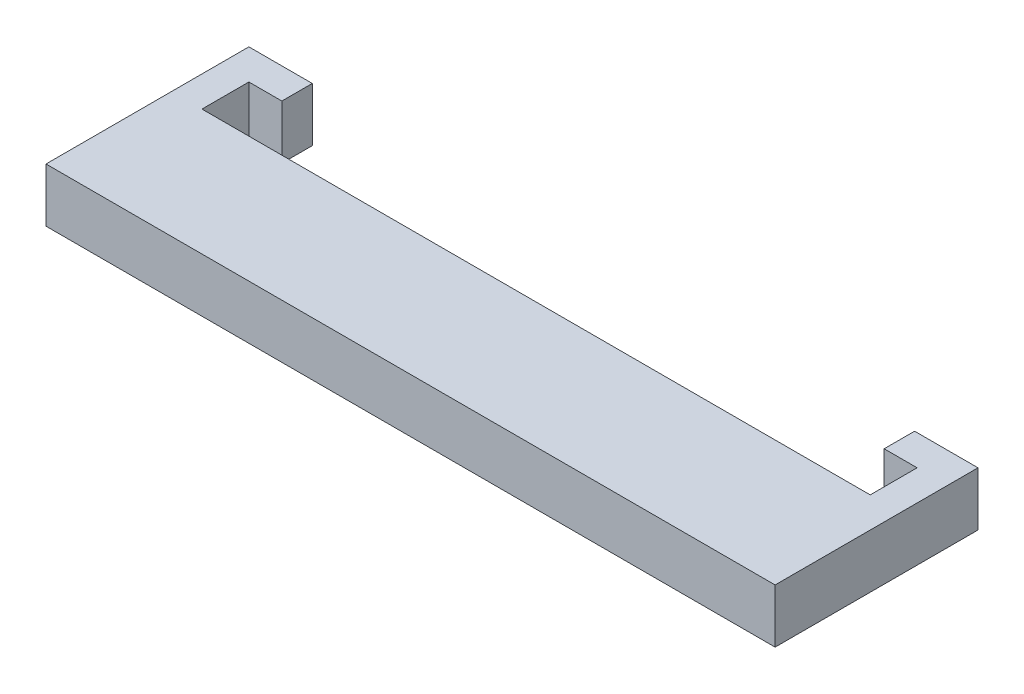
ISO-10303-21;
HEADER;
FILE_DESCRIPTION(('STEP AP214'),'2;1');
FILE_NAME('part.step','',(''),(''),'','','');
FILE_SCHEMA(('AUTOMOTIVE_DESIGN { 1 0 10303 214 1 1 1 1 }'));
ENDSEC;
DATA;
#1=APPLICATION_CONTEXT('core data for automotive mechanical design processes');
#2=APPLICATION_PROTOCOL_DEFINITION('international standard','automotive_design',2000,#1);
#3=PRODUCT_CONTEXT('',#1,'mechanical');
#4=PRODUCT('Part','Part','',(#3));
#5=PRODUCT_RELATED_PRODUCT_CATEGORY('part','',(#4));
#6=PRODUCT_DEFINITION_FORMATION('','',#4);
#7=PRODUCT_DEFINITION_CONTEXT('part definition',#1,'design');
#8=PRODUCT_DEFINITION('design','',#6,#7);
#9=PRODUCT_DEFINITION_SHAPE('','',#8);
#10=(LENGTH_UNIT() NAMED_UNIT(*) SI_UNIT(.MILLI.,.METRE.));
#11=(NAMED_UNIT(*) PLANE_ANGLE_UNIT() SI_UNIT($,.RADIAN.));
#12=(NAMED_UNIT(*) SI_UNIT($,.STERADIAN.) SOLID_ANGLE_UNIT());
#13=UNCERTAINTY_MEASURE_WITH_UNIT(LENGTH_MEASURE(1.E-05),#10,'distance_accuracy_value','');
#14=(GEOMETRIC_REPRESENTATION_CONTEXT(3) GLOBAL_UNCERTAINTY_ASSIGNED_CONTEXT((#13)) GLOBAL_UNIT_ASSIGNED_CONTEXT((#10,
#11,#12)) REPRESENTATION_CONTEXT('',''));
#15=CARTESIAN_POINT('',(0.,0.,0.));
#16=DIRECTION('',(0.,0.,1.));
#17=DIRECTION('',(1.,0.,0.));
#18=AXIS2_PLACEMENT_3D('',#15,#16,#17);
#19=CARTESIAN_POINT('',(0.,8.5,0.2));
#20=DIRECTION('',(0.,0.,-1.));
#21=DIRECTION('',(-1.,0.,0.));
#22=AXIS2_PLACEMENT_3D('',#19,#20,#21);
#23=PLANE('',#22);
#24=DIRECTION('',(1.,0.,0.));
#25=VECTOR('',#24,1.);
#26=CARTESIAN_POINT('',(0.,0.,0.2));
#27=LINE('',#26,#25);
#28=CARTESIAN_POINT('',(-0.2,0.,0.2));
#29=VERTEX_POINT('',#28);
#30=CARTESIAN_POINT('',(105.2,0.,0.2));
#31=VERTEX_POINT('',#30);
#32=EDGE_CURVE('E165',#29,#31,#27,.T.);
#33=ORIENTED_EDGE('',*,*,#32,.F.);
#34=DIRECTION('',(0.,-1.,0.));
#35=VECTOR('',#34,1.);
#36=CARTESIAN_POINT('',(-0.2,8.5,0.2));
#37=LINE('',#36,#35);
#38=CARTESIAN_POINT('',(-0.2,8.5,0.2));
#39=VERTEX_POINT('',#38);
#40=EDGE_CURVE('E11',#39,#29,#37,.T.);
#41=ORIENTED_EDGE('',*,*,#40,.F.);
#42=DIRECTION('',(1.,0.,0.));
#43=VECTOR('',#42,1.);
#44=CARTESIAN_POINT('',(0.,8.5,0.2));
#45=LINE('',#44,#43);
#46=CARTESIAN_POINT('',(105.2,8.5,0.2));
#47=VERTEX_POINT('',#46);
#48=EDGE_CURVE('E204',#39,#47,#45,.T.);
#49=ORIENTED_EDGE('',*,*,#48,.T.);
#50=DIRECTION('',(0.,-1.,0.));
#51=VECTOR('',#50,1.);
#52=CARTESIAN_POINT('',(105.2,8.5,0.2));
#53=LINE('',#52,#51);
#54=EDGE_CURVE('E56',#47,#31,#53,.T.);
#55=ORIENTED_EDGE('',*,*,#54,.T.);
#56=EDGE_LOOP('',(#33,#41,#49,#55));
#57=FACE_BOUND('',#56,.T.);
#58=ADVANCED_FACE('F39',(#57),#23,.T.);
#59=CARTESIAN_POINT('',(-0.2,8.5,0.));
#60=DIRECTION('',(-1.,0.,0.));
#61=DIRECTION('',(0.,0.,1.));
#62=AXIS2_PLACEMENT_3D('',#59,#60,#61);
#63=PLANE('',#62);
#64=DIRECTION('',(0.,0.,-1.));
#65=VECTOR('',#64,1.);
#66=CARTESIAN_POINT('',(-0.2,0.,0.));
#67=LINE('',#66,#65);
#68=CARTESIAN_POINT('',(-0.2,0.,-7.2));
#69=VERTEX_POINT('',#68);
#70=EDGE_CURVE('E168',#29,#69,#67,.T.);
#71=ORIENTED_EDGE('',*,*,#70,.T.);
#72=DIRECTION('',(0.,-1.,0.));
#73=VECTOR('',#72,1.);
#74=CARTESIAN_POINT('',(-0.2,8.5,-7.2));
#75=LINE('',#74,#73);
#76=CARTESIAN_POINT('',(-0.2,8.5,-7.2));
#77=VERTEX_POINT('',#76);
#78=EDGE_CURVE('E48',#77,#69,#75,.T.);
#79=ORIENTED_EDGE('',*,*,#78,.F.);
#80=DIRECTION('',(0.,0.,-1.));
#81=VECTOR('',#80,1.);
#82=CARTESIAN_POINT('',(-0.2,8.5,0.));
#83=LINE('',#82,#81);
#84=EDGE_CURVE('E404',#39,#77,#83,.T.);
#85=ORIENTED_EDGE('',*,*,#84,.F.);
#86=ORIENTED_EDGE('',*,*,#40,.T.);
#87=EDGE_LOOP('',(#71,#79,#85,#86));
#88=FACE_BOUND('',#87,.T.);
#89=ADVANCED_FACE('F291',(#88),#63,.F.);
#90=CARTESIAN_POINT('',(0.,8.5,-7.2));
#91=DIRECTION('',(0.,0.,-1.));
#92=DIRECTION('',(-1.,0.,0.));
#93=AXIS2_PLACEMENT_3D('',#90,#91,#92);
#94=PLANE('',#93);
#95=DIRECTION('',(1.,0.,0.));
#96=VECTOR('',#95,1.);
#97=CARTESIAN_POINT('',(0.,0.,-7.2));
#98=LINE('',#97,#96);
#99=CARTESIAN_POINT('',(5.,0.,-7.2));
#100=VERTEX_POINT('',#99);
#101=EDGE_CURVE('E171',#69,#100,#98,.T.);
#102=ORIENTED_EDGE('',*,*,#101,.T.);
#103=DIRECTION('',(0.,-1.,0.));
#104=VECTOR('',#103,1.);
#105=CARTESIAN_POINT('',(5.,8.5,-7.2));
#106=LINE('',#105,#104);
#107=CARTESIAN_POINT('',(5.,8.5,-7.2));
#108=VERTEX_POINT('',#107);
#109=EDGE_CURVE('E229',#108,#100,#106,.T.);
#110=ORIENTED_EDGE('',*,*,#109,.F.);
#111=DIRECTION('',(1.,0.,0.));
#112=VECTOR('',#111,1.);
#113=CARTESIAN_POINT('',(0.,8.5,-7.2));
#114=LINE('',#113,#112);
#115=EDGE_CURVE('E240',#77,#108,#114,.T.);
#116=ORIENTED_EDGE('',*,*,#115,.F.);
#117=ORIENTED_EDGE('',*,*,#78,.T.);
#118=EDGE_LOOP('',(#102,#110,#116,#117));
#119=FACE_BOUND('',#118,.T.);
#120=ADVANCED_FACE('F238',(#119),#94,.F.);
#121=CARTESIAN_POINT('',(5.,8.5,0.));
#122=DIRECTION('',(-1.,0.,0.));
#123=DIRECTION('',(0.,0.,1.));
#124=AXIS2_PLACEMENT_3D('',#121,#122,#123);
#125=PLANE('',#124);
#126=DIRECTION('',(0.,0.,-1.));
#127=VECTOR('',#126,1.);
#128=CARTESIAN_POINT('',(5.,0.,0.));
#129=LINE('',#128,#127);
#130=CARTESIAN_POINT('',(5.,0.,-12.));
#131=VERTEX_POINT('',#130);
#132=EDGE_CURVE('E174',#100,#131,#129,.T.);
#133=ORIENTED_EDGE('',*,*,#132,.T.);
#134=DIRECTION('',(0.,-1.,0.));
#135=VECTOR('',#134,1.);
#136=CARTESIAN_POINT('',(5.,8.5,-12.));
#137=LINE('',#136,#135);
#138=CARTESIAN_POINT('',(5.,8.5,-12.));
#139=VERTEX_POINT('',#138);
#140=EDGE_CURVE('E225',#139,#131,#137,.T.);
#141=ORIENTED_EDGE('',*,*,#140,.F.);
#142=DIRECTION('',(0.,0.,-1.));
#143=VECTOR('',#142,1.);
#144=CARTESIAN_POINT('',(5.,8.5,0.));
#145=LINE('',#144,#143);
#146=EDGE_CURVE('E260',#108,#139,#145,.T.);
#147=ORIENTED_EDGE('',*,*,#146,.F.);
#148=ORIENTED_EDGE('',*,*,#109,.T.);
#149=EDGE_LOOP('',(#133,#141,#147,#148));
#150=FACE_BOUND('',#149,.T.);
#151=ADVANCED_FACE('F250',(#150),#125,.F.);
#152=CARTESIAN_POINT('',(0.,8.5,-12.));
#153=DIRECTION('',(0.,0.,1.));
#154=DIRECTION('',(1.,0.,0.));
#155=AXIS2_PLACEMENT_3D('',#152,#153,#154);
#156=PLANE('',#155);
#157=DIRECTION('',(-1.,0.,0.));
#158=VECTOR('',#157,1.);
#159=CARTESIAN_POINT('',(0.,0.,-12.));
#160=LINE('',#159,#158);
#161=CARTESIAN_POINT('',(-5.,0.,-12.));
#162=VERTEX_POINT('',#161);
#163=EDGE_CURVE('E177',#131,#162,#160,.T.);
#164=ORIENTED_EDGE('',*,*,#163,.T.);
#165=DIRECTION('',(0.,-1.,0.));
#166=VECTOR('',#165,1.);
#167=CARTESIAN_POINT('',(-5.,8.5,-12.));
#168=LINE('',#167,#166);
#169=CARTESIAN_POINT('',(-5.,8.5,-12.));
#170=VERTEX_POINT('',#169);
#171=EDGE_CURVE('E221',#170,#162,#168,.T.);
#172=ORIENTED_EDGE('',*,*,#171,.F.);
#173=DIRECTION('',(-1.,0.,0.));
#174=VECTOR('',#173,1.);
#175=CARTESIAN_POINT('',(0.,8.5,-12.));
#176=LINE('',#175,#174);
#177=EDGE_CURVE('E256',#139,#170,#176,.T.);
#178=ORIENTED_EDGE('',*,*,#177,.F.);
#179=ORIENTED_EDGE('',*,*,#140,.T.);
#180=EDGE_LOOP('',(#164,#172,#178,#179));
#181=FACE_BOUND('',#180,.T.);
#182=ADVANCED_FACE('F254',(#181),#156,.F.);
#183=CARTESIAN_POINT('',(-5.,8.5,0.));
#184=DIRECTION('',(1.,0.,0.));
#185=DIRECTION('',(0.,0.,-1.));
#186=AXIS2_PLACEMENT_3D('',#183,#184,#185);
#187=PLANE('',#186);
#188=DIRECTION('',(0.,0.,1.));
#189=VECTOR('',#188,1.);
#190=CARTESIAN_POINT('',(-5.,0.,0.));
#191=LINE('',#190,#189);
#192=CARTESIAN_POINT('',(-5.,0.,20.));
#193=VERTEX_POINT('',#192);
#194=EDGE_CURVE('E180',#162,#193,#191,.T.);
#195=ORIENTED_EDGE('',*,*,#194,.T.);
#196=DIRECTION('',(0.,-1.,0.));
#197=VECTOR('',#196,1.);
#198=CARTESIAN_POINT('',(-5.,8.5,20.));
#199=LINE('',#198,#197);
#200=CARTESIAN_POINT('',(-5.,8.5,20.));
#201=VERTEX_POINT('',#200);
#202=EDGE_CURVE('E217',#201,#193,#199,.T.);
#203=ORIENTED_EDGE('',*,*,#202,.F.);
#204=DIRECTION('',(0.,0.,1.));
#205=VECTOR('',#204,1.);
#206=CARTESIAN_POINT('',(-5.,8.5,0.));
#207=LINE('',#206,#205);
#208=EDGE_CURVE('E259',#170,#201,#207,.T.);
#209=ORIENTED_EDGE('',*,*,#208,.F.);
#210=ORIENTED_EDGE('',*,*,#171,.T.);
#211=EDGE_LOOP('',(#195,#203,#209,#210));
#212=FACE_BOUND('',#211,.T.);
#213=ADVANCED_FACE('F304',(#212),#187,.F.);
#214=CARTESIAN_POINT('',(0.,8.5,20.));
#215=DIRECTION('',(0.,0.,-1.));
#216=DIRECTION('',(-1.,0.,0.));
#217=AXIS2_PLACEMENT_3D('',#214,#215,#216);
#218=PLANE('',#217);
#219=DIRECTION('',(1.,0.,0.));
#220=VECTOR('',#219,1.);
#221=CARTESIAN_POINT('',(0.,0.,20.));
#222=LINE('',#221,#220);
#223=CARTESIAN_POINT('',(110.,0.,20.));
#224=VERTEX_POINT('',#223);
#225=EDGE_CURVE('E183',#193,#224,#222,.T.);
#226=ORIENTED_EDGE('',*,*,#225,.T.);
#227=DIRECTION('',(0.,-1.,0.));
#228=VECTOR('',#227,1.);
#229=CARTESIAN_POINT('',(110.,8.5,20.));
#230=LINE('',#229,#228);
#231=CARTESIAN_POINT('',(110.,8.5,20.));
#232=VERTEX_POINT('',#231);
#233=EDGE_CURVE('E214',#232,#224,#230,.T.);
#234=ORIENTED_EDGE('',*,*,#233,.F.);
#235=DIRECTION('',(1.,0.,0.));
#236=VECTOR('',#235,1.);
#237=CARTESIAN_POINT('',(0.,8.5,20.));
#238=LINE('',#237,#236);
#239=EDGE_CURVE('E264',#201,#232,#238,.T.);
#240=ORIENTED_EDGE('',*,*,#239,.F.);
#241=ORIENTED_EDGE('',*,*,#202,.T.);
#242=EDGE_LOOP('',(#226,#234,#240,#241));
#243=FACE_BOUND('',#242,.T.);
#244=ADVANCED_FACE('F307',(#243),#218,.F.);
#245=CARTESIAN_POINT('',(110.,8.5,0.));
#246=DIRECTION('',(1.,0.,0.));
#247=DIRECTION('',(0.,0.,-1.));
#248=AXIS2_PLACEMENT_3D('',#245,#246,#247);
#249=PLANE('',#248);
#250=DIRECTION('',(0.,0.,1.));
#251=VECTOR('',#250,1.);
#252=CARTESIAN_POINT('',(110.,0.,0.));
#253=LINE('',#252,#251);
#254=CARTESIAN_POINT('',(110.,0.,-12.));
#255=VERTEX_POINT('',#254);
#256=EDGE_CURVE('E187',#255,#224,#253,.T.);
#257=ORIENTED_EDGE('',*,*,#256,.F.);
#258=DIRECTION('',(0.,-1.,0.));
#259=VECTOR('',#258,1.);
#260=CARTESIAN_POINT('',(110.,8.5,-12.));
#261=LINE('',#260,#259);
#262=CARTESIAN_POINT('',(110.,8.5,-12.));
#263=VERTEX_POINT('',#262);
#264=EDGE_CURVE('E211',#263,#255,#261,.T.);
#265=ORIENTED_EDGE('',*,*,#264,.F.);
#266=DIRECTION('',(0.,0.,1.));
#267=VECTOR('',#266,1.);
#268=CARTESIAN_POINT('',(110.,8.5,0.));
#269=LINE('',#268,#267);
#270=EDGE_CURVE('E159',#263,#232,#269,.T.);
#271=ORIENTED_EDGE('',*,*,#270,.T.);
#272=ORIENTED_EDGE('',*,*,#233,.T.);
#273=EDGE_LOOP('',(#257,#265,#271,#272));
#274=FACE_BOUND('',#273,.T.);
#275=ADVANCED_FACE('F274',(#274),#249,.T.);
#276=CARTESIAN_POINT('',(0.,8.5,-12.));
#277=DIRECTION('',(0.,0.,-1.));
#278=DIRECTION('',(-1.,0.,0.));
#279=AXIS2_PLACEMENT_3D('',#276,#277,#278);
#280=PLANE('',#279);
#281=DIRECTION('',(1.,0.,0.));
#282=VECTOR('',#281,1.);
#283=CARTESIAN_POINT('',(0.,0.,-12.));
#284=LINE('',#283,#282);
#285=CARTESIAN_POINT('',(100.,0.,-12.));
#286=VERTEX_POINT('',#285);
#287=EDGE_CURVE('E191',#286,#255,#284,.T.);
#288=ORIENTED_EDGE('',*,*,#287,.F.);
#289=DIRECTION('',(0.,-1.,0.));
#290=VECTOR('',#289,1.);
#291=CARTESIAN_POINT('',(100.,8.5,-12.));
#292=LINE('',#291,#290);
#293=CARTESIAN_POINT('',(100.,8.5,-12.));
#294=VERTEX_POINT('',#293);
#295=EDGE_CURVE('E141',#294,#286,#292,.T.);
#296=ORIENTED_EDGE('',*,*,#295,.F.);
#297=DIRECTION('',(1.,0.,0.));
#298=VECTOR('',#297,1.);
#299=CARTESIAN_POINT('',(0.,8.5,-12.));
#300=LINE('',#299,#298);
#301=EDGE_CURVE('E155',#294,#263,#300,.T.);
#302=ORIENTED_EDGE('',*,*,#301,.T.);
#303=ORIENTED_EDGE('',*,*,#264,.T.);
#304=EDGE_LOOP('',(#288,#296,#302,#303));
#305=FACE_BOUND('',#304,.T.);
#306=ADVANCED_FACE('F279',(#305),#280,.T.);
#307=CARTESIAN_POINT('',(100.,8.5,0.));
#308=DIRECTION('',(-1.,0.,0.));
#309=DIRECTION('',(0.,0.,1.));
#310=AXIS2_PLACEMENT_3D('',#307,#308,#309);
#311=PLANE('',#310);
#312=DIRECTION('',(0.,0.,-1.));
#313=VECTOR('',#312,1.);
#314=CARTESIAN_POINT('',(100.,0.,0.));
#315=LINE('',#314,#313);
#316=CARTESIAN_POINT('',(100.,0.,-7.2));
#317=VERTEX_POINT('',#316);
#318=EDGE_CURVE('E137',#317,#286,#315,.T.);
#319=ORIENTED_EDGE('',*,*,#318,.F.);
#320=DIRECTION('',(0.,-1.,0.));
#321=VECTOR('',#320,1.);
#322=CARTESIAN_POINT('',(100.,8.5,-7.2));
#323=LINE('',#322,#321);
#324=CARTESIAN_POINT('',(100.,8.5,-7.2));
#325=VERTEX_POINT('',#324);
#326=EDGE_CURVE('E131',#325,#317,#323,.T.);
#327=ORIENTED_EDGE('',*,*,#326,.F.);
#328=DIRECTION('',(0.,0.,-1.));
#329=VECTOR('',#328,1.);
#330=CARTESIAN_POINT('',(100.,8.5,0.));
#331=LINE('',#330,#329);
#332=EDGE_CURVE('E135',#325,#294,#331,.T.);
#333=ORIENTED_EDGE('',*,*,#332,.T.);
#334=ORIENTED_EDGE('',*,*,#295,.T.);
#335=EDGE_LOOP('',(#319,#327,#333,#334));
#336=FACE_BOUND('',#335,.T.);
#337=ADVANCED_FACE('F133',(#336),#311,.T.);
#338=CARTESIAN_POINT('',(0.,8.5,-7.2));
#339=DIRECTION('',(0.,0.,-1.));
#340=DIRECTION('',(-1.,0.,0.));
#341=AXIS2_PLACEMENT_3D('',#338,#339,#340);
#342=PLANE('',#341);
#343=DIRECTION('',(1.,0.,0.));
#344=VECTOR('',#343,1.);
#345=CARTESIAN_POINT('',(0.,0.,-7.2));
#346=LINE('',#345,#344);
#347=CARTESIAN_POINT('',(105.2,0.,-7.2));
#348=VERTEX_POINT('',#347);
#349=EDGE_CURVE('E197',#317,#348,#346,.T.);
#350=ORIENTED_EDGE('',*,*,#349,.T.);
#351=DIRECTION('',(0.,-1.,0.));
#352=VECTOR('',#351,1.);
#353=CARTESIAN_POINT('',(105.2,8.5,-7.2));
#354=LINE('',#353,#352);
#355=CARTESIAN_POINT('',(105.2,8.5,-7.2));
#356=VERTEX_POINT('',#355);
#357=EDGE_CURVE('E94',#356,#348,#354,.T.);
#358=ORIENTED_EDGE('',*,*,#357,.F.);
#359=DIRECTION('',(1.,0.,0.));
#360=VECTOR('',#359,1.);
#361=CARTESIAN_POINT('',(0.,8.5,-7.2));
#362=LINE('',#361,#360);
#363=EDGE_CURVE('E143',#325,#356,#362,.T.);
#364=ORIENTED_EDGE('',*,*,#363,.F.);
#365=ORIENTED_EDGE('',*,*,#326,.T.);
#366=EDGE_LOOP('',(#350,#358,#364,#365));
#367=FACE_BOUND('',#366,.T.);
#368=ADVANCED_FACE('F144',(#367),#342,.F.);
#369=CARTESIAN_POINT('',(105.2,8.5,0.));
#370=DIRECTION('',(-1.,0.,0.));
#371=DIRECTION('',(0.,0.,1.));
#372=AXIS2_PLACEMENT_3D('',#369,#370,#371);
#373=PLANE('',#372);
#374=DIRECTION('',(0.,0.,-1.));
#375=VECTOR('',#374,1.);
#376=CARTESIAN_POINT('',(105.2,0.,0.));
#377=LINE('',#376,#375);
#378=EDGE_CURVE('E200',#31,#348,#377,.T.);
#379=ORIENTED_EDGE('',*,*,#378,.F.);
#380=ORIENTED_EDGE('',*,*,#54,.F.);
#381=DIRECTION('',(0.,0.,-1.));
#382=VECTOR('',#381,1.);
#383=CARTESIAN_POINT('',(105.2,8.5,0.));
#384=LINE('',#383,#382);
#385=EDGE_CURVE('E148',#47,#356,#384,.T.);
#386=ORIENTED_EDGE('',*,*,#385,.T.);
#387=ORIENTED_EDGE('',*,*,#357,.T.);
#388=EDGE_LOOP('',(#379,#380,#386,#387));
#389=FACE_BOUND('',#388,.T.);
#390=ADVANCED_FACE('F280',(#389),#373,.T.);
#391=CARTESIAN_POINT('',(0.,8.5,0.));
#392=DIRECTION('',(0.,1.,0.));
#393=DIRECTION('',(0.,0.,1.));
#394=AXIS2_PLACEMENT_3D('',#391,#392,#393);
#395=PLANE('',#394);
#396=ORIENTED_EDGE('',*,*,#48,.F.);
#397=ORIENTED_EDGE('',*,*,#84,.T.);
#398=ORIENTED_EDGE('',*,*,#115,.T.);
#399=ORIENTED_EDGE('',*,*,#146,.T.);
#400=ORIENTED_EDGE('',*,*,#177,.T.);
#401=ORIENTED_EDGE('',*,*,#208,.T.);
#402=ORIENTED_EDGE('',*,*,#239,.T.);
#403=ORIENTED_EDGE('',*,*,#270,.F.);
#404=ORIENTED_EDGE('',*,*,#301,.F.);
#405=ORIENTED_EDGE('',*,*,#332,.F.);
#406=ORIENTED_EDGE('',*,*,#363,.T.);
#407=ORIENTED_EDGE('',*,*,#385,.F.);
#408=EDGE_LOOP('',(#396,#397,#398,#399,#400,#401,#402,#403,#404,#405,#406,#407));
#409=FACE_BOUND('',#408,.T.);
#410=ADVANCED_FACE('F152',(#409),#395,.T.);
#411=CARTESIAN_POINT('',(0.,0.,0.));
#412=DIRECTION('',(0.,1.,0.));
#413=DIRECTION('',(0.,0.,1.));
#414=AXIS2_PLACEMENT_3D('',#411,#412,#413);
#415=PLANE('',#414);
#416=ORIENTED_EDGE('',*,*,#32,.T.);
#417=ORIENTED_EDGE('',*,*,#378,.T.);
#418=ORIENTED_EDGE('',*,*,#349,.F.);
#419=ORIENTED_EDGE('',*,*,#318,.T.);
#420=ORIENTED_EDGE('',*,*,#287,.T.);
#421=ORIENTED_EDGE('',*,*,#256,.T.);
#422=ORIENTED_EDGE('',*,*,#225,.F.);
#423=ORIENTED_EDGE('',*,*,#194,.F.);
#424=ORIENTED_EDGE('',*,*,#163,.F.);
#425=ORIENTED_EDGE('',*,*,#132,.F.);
#426=ORIENTED_EDGE('',*,*,#101,.F.);
#427=ORIENTED_EDGE('',*,*,#70,.F.);
#428=EDGE_LOOP('',(#416,#417,#418,#419,#420,#421,#422,#423,#424,#425,#426,#427));
#429=FACE_BOUND('',#428,.T.);
#430=ADVANCED_FACE('F245',(#429),#415,.F.);
#431=CLOSED_SHELL('',(#58,#89,#120,#151,#182,#213,#244,#275,#306,#337,#368,#390,#410,#430));
#432=MANIFOLD_SOLID_BREP('B2',#431);
#433=ADVANCED_BREP_SHAPE_REPRESENTATION('',(#18,#432),#14);
#434=SHAPE_DEFINITION_REPRESENTATION(#9,#433);
ENDSEC;
END-ISO-10303-21;
